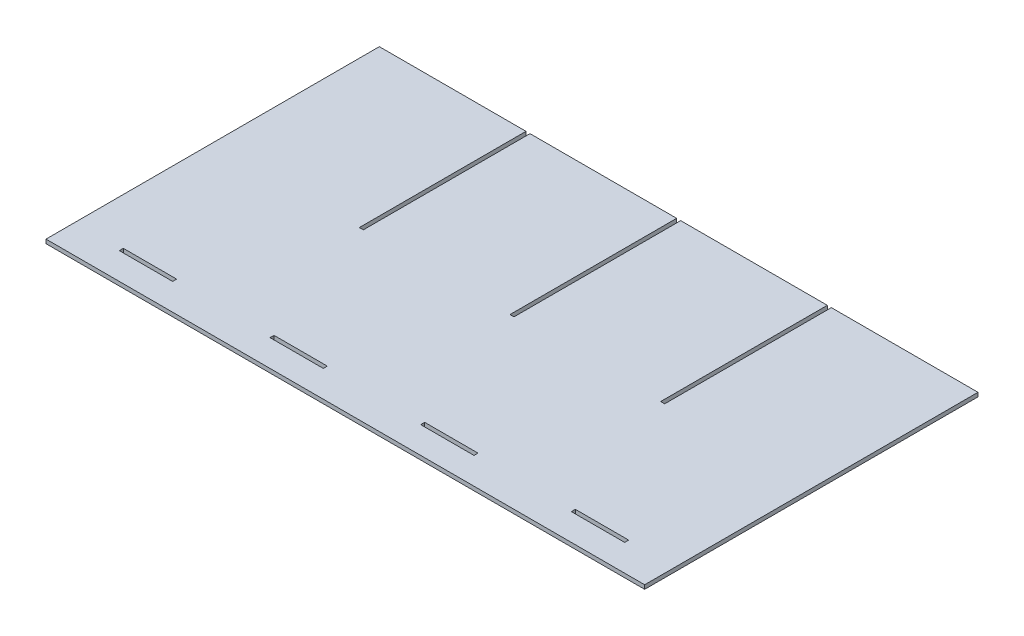
ISO-10303-21;
HEADER;
FILE_DESCRIPTION(('STEP AP214'),'2;1');
FILE_NAME('part.step','',(''),(''),'','','');
FILE_SCHEMA(('AUTOMOTIVE_DESIGN { 1 0 10303 214 1 1 1 1 }'));
ENDSEC;
DATA;
#1=APPLICATION_CONTEXT('core data for automotive mechanical design processes');
#2=APPLICATION_PROTOCOL_DEFINITION('international standard','automotive_design',2000,#1);
#3=PRODUCT_CONTEXT('',#1,'mechanical');
#4=PRODUCT('Part','Part','',(#3));
#5=PRODUCT_RELATED_PRODUCT_CATEGORY('part','',(#4));
#6=PRODUCT_DEFINITION_FORMATION('','',#4);
#7=PRODUCT_DEFINITION_CONTEXT('part definition',#1,'design');
#8=PRODUCT_DEFINITION('design','',#6,#7);
#9=PRODUCT_DEFINITION_SHAPE('','',#8);
#10=(LENGTH_UNIT() NAMED_UNIT(*) SI_UNIT(.MILLI.,.METRE.));
#11=(NAMED_UNIT(*) PLANE_ANGLE_UNIT() SI_UNIT($,.RADIAN.));
#12=(NAMED_UNIT(*) SI_UNIT($,.STERADIAN.) SOLID_ANGLE_UNIT());
#13=UNCERTAINTY_MEASURE_WITH_UNIT(LENGTH_MEASURE(1.E-05),#10,'distance_accuracy_value','');
#14=(GEOMETRIC_REPRESENTATION_CONTEXT(3) GLOBAL_UNCERTAINTY_ASSIGNED_CONTEXT((#13)) GLOBAL_UNIT_ASSIGNED_CONTEXT((#10,
#11,#12)) REPRESENTATION_CONTEXT('',''));
#15=CARTESIAN_POINT('',(0.,0.,0.));
#16=DIRECTION('',(0.,0.,1.));
#17=DIRECTION('',(1.,0.,0.));
#18=AXIS2_PLACEMENT_3D('',#15,#16,#17);
#19=CARTESIAN_POINT('',(-52.3685079528151,3.,-89.945054945055));
#20=DIRECTION('',(-1.,0.,0.));
#21=DIRECTION('',(0.,0.,1.));
#22=AXIS2_PLACEMENT_3D('',#19,#20,#21);
#23=PLANE('',#22);
#24=DIRECTION('',(0.,0.,-1.));
#25=VECTOR('',#24,1.);
#26=CARTESIAN_POINT('',(-52.3685079528151,0.,-89.945054945055));
#27=LINE('',#26,#25);
#28=CARTESIAN_POINT('',(-52.3685079528151,0.,35.054945054945));
#29=VERTEX_POINT('',#28);
#30=CARTESIAN_POINT('',(-52.3685079528151,0.,-89.945054945055));
#31=VERTEX_POINT('',#30);
#32=EDGE_CURVE('E295',#29,#31,#27,.T.);
#33=ORIENTED_EDGE('',*,*,#32,.T.);
#34=DIRECTION('',(0.,-1.,0.));
#35=VECTOR('',#34,1.);
#36=CARTESIAN_POINT('',(-52.3685079528151,3.,-89.945054945055));
#37=LINE('',#36,#35);
#38=CARTESIAN_POINT('',(-52.3685079528151,3.,-89.945054945055));
#39=VERTEX_POINT('',#38);
#40=EDGE_CURVE('E11',#39,#31,#37,.T.);
#41=ORIENTED_EDGE('',*,*,#40,.F.);
#42=DIRECTION('',(0.,0.,-1.));
#43=VECTOR('',#42,1.);
#44=CARTESIAN_POINT('',(-52.3685079528151,3.,-89.945054945055));
#45=LINE('',#44,#43);
#46=CARTESIAN_POINT('',(-52.3685079528151,3.,35.054945054945));
#47=VERTEX_POINT('',#46);
#48=EDGE_CURVE('E430',#47,#39,#45,.T.);
#49=ORIENTED_EDGE('',*,*,#48,.F.);
#50=DIRECTION('',(0.,-1.,0.));
#51=VECTOR('',#50,1.);
#52=CARTESIAN_POINT('',(-52.3685079528151,3.,35.054945054945));
#53=LINE('',#52,#51);
#54=EDGE_CURVE('E480',#47,#29,#53,.T.);
#55=ORIENTED_EDGE('',*,*,#54,.T.);
#56=EDGE_LOOP('',(#33,#41,#49,#55));
#57=FACE_BOUND('',#56,.T.);
#58=ADVANCED_FACE('F39',(#57),#23,.F.);
#59=CARTESIAN_POINT('',(-162.368507952815,3.,-89.945054945055));
#60=DIRECTION('',(0.,0.,1.));
#61=DIRECTION('',(1.,0.,0.));
#62=AXIS2_PLACEMENT_3D('',#59,#60,#61);
#63=PLANE('',#62);
#64=DIRECTION('',(-1.,0.,0.));
#65=VECTOR('',#64,1.);
#66=CARTESIAN_POINT('',(-162.368507952815,0.,-89.945054945055));
#67=LINE('',#66,#65);
#68=CARTESIAN_POINT('',(-162.368507952815,0.,-89.945054945055));
#69=VERTEX_POINT('',#68);
#70=EDGE_CURVE('E484',#31,#69,#67,.T.);
#71=ORIENTED_EDGE('',*,*,#70,.T.);
#72=DIRECTION('',(0.,-1.,0.));
#73=VECTOR('',#72,1.);
#74=CARTESIAN_POINT('',(-162.368507952815,3.,-89.945054945055));
#75=LINE('',#74,#73);
#76=CARTESIAN_POINT('',(-162.368507952815,3.,-89.945054945055));
#77=VERTEX_POINT('',#76);
#78=EDGE_CURVE('E47',#77,#69,#75,.T.);
#79=ORIENTED_EDGE('',*,*,#78,.F.);
#80=DIRECTION('',(-1.,0.,0.));
#81=VECTOR('',#80,1.);
#82=CARTESIAN_POINT('',(-162.368507952815,3.,-89.945054945055));
#83=LINE('',#82,#81);
#84=EDGE_CURVE('E434',#39,#77,#83,.T.);
#85=ORIENTED_EDGE('',*,*,#84,.F.);
#86=ORIENTED_EDGE('',*,*,#40,.T.);
#87=EDGE_LOOP('',(#71,#79,#85,#86));
#88=FACE_BOUND('',#87,.T.);
#89=ADVANCED_FACE('F610',(#88),#63,.F.);
#90=CARTESIAN_POINT('',(-162.368507952815,3.,160.054945054945));
#91=DIRECTION('',(1.,0.,0.));
#92=DIRECTION('',(0.,0.,-1.));
#93=AXIS2_PLACEMENT_3D('',#90,#91,#92);
#94=PLANE('',#93);
#95=DIRECTION('',(0.,0.,1.));
#96=VECTOR('',#95,1.);
#97=CARTESIAN_POINT('',(-162.368507952815,0.,160.054945054945));
#98=LINE('',#97,#96);
#99=CARTESIAN_POINT('',(-162.368507952815,0.,160.054945054945));
#100=VERTEX_POINT('',#99);
#101=EDGE_CURVE('E487',#69,#100,#98,.T.);
#102=ORIENTED_EDGE('',*,*,#101,.T.);
#103=DIRECTION('',(0.,-1.,0.));
#104=VECTOR('',#103,1.);
#105=CARTESIAN_POINT('',(-162.368507952815,3.,160.054945054945));
#106=LINE('',#105,#104);
#107=CARTESIAN_POINT('',(-162.368507952815,3.,160.054945054945));
#108=VERTEX_POINT('',#107);
#109=EDGE_CURVE('E579',#108,#100,#106,.T.);
#110=ORIENTED_EDGE('',*,*,#109,.F.);
#111=DIRECTION('',(0.,0.,1.));
#112=VECTOR('',#111,1.);
#113=CARTESIAN_POINT('',(-162.368507952815,3.,160.054945054945));
#114=LINE('',#113,#112);
#115=EDGE_CURVE('E438',#77,#108,#114,.T.);
#116=ORIENTED_EDGE('',*,*,#115,.F.);
#117=ORIENTED_EDGE('',*,*,#78,.T.);
#118=EDGE_LOOP('',(#102,#110,#116,#117));
#119=FACE_BOUND('',#118,.T.);
#120=ADVANCED_FACE('F588',(#119),#94,.F.);
#121=CARTESIAN_POINT('',(286.631492047185,3.,160.054945054945));
#122=DIRECTION('',(0.,0.,-1.));
#123=DIRECTION('',(-1.,0.,0.));
#124=AXIS2_PLACEMENT_3D('',#121,#122,#123);
#125=PLANE('',#124);
#126=DIRECTION('',(1.,0.,0.));
#127=VECTOR('',#126,1.);
#128=CARTESIAN_POINT('',(286.631492047185,0.,160.054945054945));
#129=LINE('',#128,#127);
#130=CARTESIAN_POINT('',(286.631492047185,0.,160.054945054945));
#131=VERTEX_POINT('',#130);
#132=EDGE_CURVE('E490',#100,#131,#129,.T.);
#133=ORIENTED_EDGE('',*,*,#132,.T.);
#134=DIRECTION('',(0.,-1.,0.));
#135=VECTOR('',#134,1.);
#136=CARTESIAN_POINT('',(286.631492047185,3.,160.054945054945));
#137=LINE('',#136,#135);
#138=CARTESIAN_POINT('',(286.631492047185,3.,160.054945054945));
#139=VERTEX_POINT('',#138);
#140=EDGE_CURVE('E575',#139,#131,#137,.T.);
#141=ORIENTED_EDGE('',*,*,#140,.F.);
#142=DIRECTION('',(1.,0.,0.));
#143=VECTOR('',#142,1.);
#144=CARTESIAN_POINT('',(286.631492047185,3.,160.054945054945));
#145=LINE('',#144,#143);
#146=EDGE_CURVE('E441',#108,#139,#145,.T.);
#147=ORIENTED_EDGE('',*,*,#146,.F.);
#148=ORIENTED_EDGE('',*,*,#109,.T.);
#149=EDGE_LOOP('',(#133,#141,#147,#148));
#150=FACE_BOUND('',#149,.T.);
#151=ADVANCED_FACE('F598',(#150),#125,.F.);
#152=CARTESIAN_POINT('',(286.631492047185,3.,-89.945054945055));
#153=DIRECTION('',(-1.,0.,0.));
#154=DIRECTION('',(0.,0.,1.));
#155=AXIS2_PLACEMENT_3D('',#152,#153,#154);
#156=PLANE('',#155);
#157=DIRECTION('',(0.,0.,-1.));
#158=VECTOR('',#157,1.);
#159=CARTESIAN_POINT('',(286.631492047185,0.,-89.945054945055));
#160=LINE('',#159,#158);
#161=CARTESIAN_POINT('',(286.631492047185,0.,-89.945054945055));
#162=VERTEX_POINT('',#161);
#163=EDGE_CURVE('E493',#131,#162,#160,.T.);
#164=ORIENTED_EDGE('',*,*,#163,.T.);
#165=DIRECTION('',(0.,-1.,0.));
#166=VECTOR('',#165,1.);
#167=CARTESIAN_POINT('',(286.631492047185,3.,-89.945054945055));
#168=LINE('',#167,#166);
#169=CARTESIAN_POINT('',(286.631492047185,3.,-89.945054945055));
#170=VERTEX_POINT('',#169);
#171=EDGE_CURVE('E571',#170,#162,#168,.T.);
#172=ORIENTED_EDGE('',*,*,#171,.F.);
#173=DIRECTION('',(0.,0.,-1.));
#174=VECTOR('',#173,1.);
#175=CARTESIAN_POINT('',(286.631492047185,3.,-89.945054945055));
#176=LINE('',#175,#174);
#177=EDGE_CURVE('E444',#139,#170,#176,.T.);
#178=ORIENTED_EDGE('',*,*,#177,.F.);
#179=ORIENTED_EDGE('',*,*,#140,.T.);
#180=EDGE_LOOP('',(#164,#172,#178,#179));
#181=FACE_BOUND('',#180,.T.);
#182=ADVANCED_FACE('F602',(#181),#156,.F.);
#183=CARTESIAN_POINT('',(176.631492047185,3.,-89.945054945055));
#184=DIRECTION('',(0.,0.,1.));
#185=DIRECTION('',(1.,0.,0.));
#186=AXIS2_PLACEMENT_3D('',#183,#184,#185);
#187=PLANE('',#186);
#188=DIRECTION('',(-1.,0.,0.));
#189=VECTOR('',#188,1.);
#190=CARTESIAN_POINT('',(176.631492047185,0.,-89.945054945055));
#191=LINE('',#190,#189);
#192=CARTESIAN_POINT('',(176.631492047185,0.,-89.945054945055));
#193=VERTEX_POINT('',#192);
#194=EDGE_CURVE('E496',#162,#193,#191,.T.);
#195=ORIENTED_EDGE('',*,*,#194,.T.);
#196=DIRECTION('',(0.,-1.,0.));
#197=VECTOR('',#196,1.);
#198=CARTESIAN_POINT('',(176.631492047185,3.,-89.945054945055));
#199=LINE('',#198,#197);
#200=CARTESIAN_POINT('',(176.631492047185,3.,-89.945054945055));
#201=VERTEX_POINT('',#200);
#202=EDGE_CURVE('E567',#201,#193,#199,.T.);
#203=ORIENTED_EDGE('',*,*,#202,.F.);
#204=DIRECTION('',(-1.,0.,0.));
#205=VECTOR('',#204,1.);
#206=CARTESIAN_POINT('',(176.631492047185,3.,-89.945054945055));
#207=LINE('',#206,#205);
#208=EDGE_CURVE('E447',#170,#201,#207,.T.);
#209=ORIENTED_EDGE('',*,*,#208,.F.);
#210=ORIENTED_EDGE('',*,*,#171,.T.);
#211=EDGE_LOOP('',(#195,#203,#209,#210));
#212=FACE_BOUND('',#211,.T.);
#213=ADVANCED_FACE('F663',(#212),#187,.F.);
#214=CARTESIAN_POINT('',(176.631492047185,3.,35.054945054945));
#215=DIRECTION('',(1.,0.,0.));
#216=DIRECTION('',(0.,0.,-1.));
#217=AXIS2_PLACEMENT_3D('',#214,#215,#216);
#218=PLANE('',#217);
#219=DIRECTION('',(0.,0.,1.));
#220=VECTOR('',#219,1.);
#221=CARTESIAN_POINT('',(176.631492047185,0.,35.054945054945));
#222=LINE('',#221,#220);
#223=CARTESIAN_POINT('',(176.631492047185,0.,35.054945054945));
#224=VERTEX_POINT('',#223);
#225=EDGE_CURVE('E499',#193,#224,#222,.T.);
#226=ORIENTED_EDGE('',*,*,#225,.T.);
#227=DIRECTION('',(0.,-1.,0.));
#228=VECTOR('',#227,1.);
#229=CARTESIAN_POINT('',(176.631492047185,3.,35.054945054945));
#230=LINE('',#229,#228);
#231=CARTESIAN_POINT('',(176.631492047185,3.,35.054945054945));
#232=VERTEX_POINT('',#231);
#233=EDGE_CURVE('E563',#232,#224,#230,.T.);
#234=ORIENTED_EDGE('',*,*,#233,.F.);
#235=DIRECTION('',(0.,0.,1.));
#236=VECTOR('',#235,1.);
#237=CARTESIAN_POINT('',(176.631492047185,3.,35.054945054945));
#238=LINE('',#237,#236);
#239=EDGE_CURVE('E450',#201,#232,#238,.T.);
#240=ORIENTED_EDGE('',*,*,#239,.F.);
#241=ORIENTED_EDGE('',*,*,#202,.T.);
#242=EDGE_LOOP('',(#226,#234,#240,#241));
#243=FACE_BOUND('',#242,.T.);
#244=ADVANCED_FACE('F660',(#243),#218,.F.);
#245=CARTESIAN_POINT('',(173.631492047185,3.,35.054945054945));
#246=DIRECTION('',(0.,0.,1.));
#247=DIRECTION('',(1.,0.,0.));
#248=AXIS2_PLACEMENT_3D('',#245,#246,#247);
#249=PLANE('',#248);
#250=DIRECTION('',(-1.,0.,0.));
#251=VECTOR('',#250,1.);
#252=CARTESIAN_POINT('',(173.631492047185,0.,35.054945054945));
#253=LINE('',#252,#251);
#254=CARTESIAN_POINT('',(173.631492047185,0.,35.054945054945));
#255=VERTEX_POINT('',#254);
#256=EDGE_CURVE('E502',#224,#255,#253,.T.);
#257=ORIENTED_EDGE('',*,*,#256,.T.);
#258=DIRECTION('',(0.,-1.,0.));
#259=VECTOR('',#258,1.);
#260=CARTESIAN_POINT('',(173.631492047185,3.,35.054945054945));
#261=LINE('',#260,#259);
#262=CARTESIAN_POINT('',(173.631492047185,3.,35.054945054945));
#263=VERTEX_POINT('',#262);
#264=EDGE_CURVE('E559',#263,#255,#261,.T.);
#265=ORIENTED_EDGE('',*,*,#264,.F.);
#266=DIRECTION('',(-1.,0.,0.));
#267=VECTOR('',#266,1.);
#268=CARTESIAN_POINT('',(173.631492047185,3.,35.054945054945));
#269=LINE('',#268,#267);
#270=EDGE_CURVE('E453',#232,#263,#269,.T.);
#271=ORIENTED_EDGE('',*,*,#270,.F.);
#272=ORIENTED_EDGE('',*,*,#233,.T.);
#273=EDGE_LOOP('',(#257,#265,#271,#272));
#274=FACE_BOUND('',#273,.T.);
#275=ADVANCED_FACE('F656',(#274),#249,.F.);
#276=CARTESIAN_POINT('',(173.631492047185,3.,-89.945054945055));
#277=DIRECTION('',(-1.,0.,0.));
#278=DIRECTION('',(0.,0.,1.));
#279=AXIS2_PLACEMENT_3D('',#276,#277,#278);
#280=PLANE('',#279);
#281=DIRECTION('',(0.,0.,-1.));
#282=VECTOR('',#281,1.);
#283=CARTESIAN_POINT('',(173.631492047185,0.,-89.945054945055));
#284=LINE('',#283,#282);
#285=CARTESIAN_POINT('',(173.631492047185,0.,-89.945054945055));
#286=VERTEX_POINT('',#285);
#287=EDGE_CURVE('E505',#255,#286,#284,.T.);
#288=ORIENTED_EDGE('',*,*,#287,.T.);
#289=DIRECTION('',(0.,-1.,0.));
#290=VECTOR('',#289,1.);
#291=CARTESIAN_POINT('',(173.631492047185,3.,-89.945054945055));
#292=LINE('',#291,#290);
#293=CARTESIAN_POINT('',(173.631492047185,3.,-89.945054945055));
#294=VERTEX_POINT('',#293);
#295=EDGE_CURVE('E555',#294,#286,#292,.T.);
#296=ORIENTED_EDGE('',*,*,#295,.F.);
#297=DIRECTION('',(0.,0.,-1.));
#298=VECTOR('',#297,1.);
#299=CARTESIAN_POINT('',(173.631492047185,3.,-89.945054945055));
#300=LINE('',#299,#298);
#301=EDGE_CURVE('E456',#263,#294,#300,.T.);
#302=ORIENTED_EDGE('',*,*,#301,.F.);
#303=ORIENTED_EDGE('',*,*,#264,.T.);
#304=EDGE_LOOP('',(#288,#296,#302,#303));
#305=FACE_BOUND('',#304,.T.);
#306=ADVANCED_FACE('F652',(#305),#280,.F.);
#307=CARTESIAN_POINT('',(63.631492047185,3.,-89.945054945055));
#308=DIRECTION('',(0.,0.,1.));
#309=DIRECTION('',(1.,0.,0.));
#310=AXIS2_PLACEMENT_3D('',#307,#308,#309);
#311=PLANE('',#310);
#312=DIRECTION('',(-1.,0.,0.));
#313=VECTOR('',#312,1.);
#314=CARTESIAN_POINT('',(63.631492047185,0.,-89.945054945055));
#315=LINE('',#314,#313);
#316=CARTESIAN_POINT('',(63.631492047185,0.,-89.945054945055));
#317=VERTEX_POINT('',#316);
#318=EDGE_CURVE('E508',#286,#317,#315,.T.);
#319=ORIENTED_EDGE('',*,*,#318,.T.);
#320=DIRECTION('',(0.,-1.,0.));
#321=VECTOR('',#320,1.);
#322=CARTESIAN_POINT('',(63.631492047185,3.,-89.945054945055));
#323=LINE('',#322,#321);
#324=CARTESIAN_POINT('',(63.631492047185,3.,-89.945054945055));
#325=VERTEX_POINT('',#324);
#326=EDGE_CURVE('E551',#325,#317,#323,.T.);
#327=ORIENTED_EDGE('',*,*,#326,.F.);
#328=DIRECTION('',(-1.,0.,0.));
#329=VECTOR('',#328,1.);
#330=CARTESIAN_POINT('',(63.631492047185,3.,-89.945054945055));
#331=LINE('',#330,#329);
#332=EDGE_CURVE('E459',#294,#325,#331,.T.);
#333=ORIENTED_EDGE('',*,*,#332,.F.);
#334=ORIENTED_EDGE('',*,*,#295,.T.);
#335=EDGE_LOOP('',(#319,#327,#333,#334));
#336=FACE_BOUND('',#335,.T.);
#337=ADVANCED_FACE('F647',(#336),#311,.F.);
#338=CARTESIAN_POINT('',(63.631492047185,3.,35.054945054945));
#339=DIRECTION('',(1.,0.,0.));
#340=DIRECTION('',(0.,0.,-1.));
#341=AXIS2_PLACEMENT_3D('',#338,#339,#340);
#342=PLANE('',#341);
#343=DIRECTION('',(0.,0.,1.));
#344=VECTOR('',#343,1.);
#345=CARTESIAN_POINT('',(63.631492047185,0.,35.054945054945));
#346=LINE('',#345,#344);
#347=CARTESIAN_POINT('',(63.631492047185,0.,35.054945054945));
#348=VERTEX_POINT('',#347);
#349=EDGE_CURVE('E511',#317,#348,#346,.T.);
#350=ORIENTED_EDGE('',*,*,#349,.T.);
#351=DIRECTION('',(0.,-1.,0.));
#352=VECTOR('',#351,1.);
#353=CARTESIAN_POINT('',(63.631492047185,3.,35.054945054945));
#354=LINE('',#353,#352);
#355=CARTESIAN_POINT('',(63.631492047185,3.,35.054945054945));
#356=VERTEX_POINT('',#355);
#357=EDGE_CURVE('E547',#356,#348,#354,.T.);
#358=ORIENTED_EDGE('',*,*,#357,.F.);
#359=DIRECTION('',(0.,0.,1.));
#360=VECTOR('',#359,1.);
#361=CARTESIAN_POINT('',(63.631492047185,3.,35.054945054945));
#362=LINE('',#361,#360);
#363=EDGE_CURVE('E462',#325,#356,#362,.T.);
#364=ORIENTED_EDGE('',*,*,#363,.F.);
#365=ORIENTED_EDGE('',*,*,#326,.T.);
#366=EDGE_LOOP('',(#350,#358,#364,#365));
#367=FACE_BOUND('',#366,.T.);
#368=ADVANCED_FACE('F641',(#367),#342,.F.);
#369=CARTESIAN_POINT('',(60.631492047185,3.,35.054945054945));
#370=DIRECTION('',(0.,0.,1.));
#371=DIRECTION('',(1.,0.,0.));
#372=AXIS2_PLACEMENT_3D('',#369,#370,#371);
#373=PLANE('',#372);
#374=DIRECTION('',(-1.,0.,0.));
#375=VECTOR('',#374,1.);
#376=CARTESIAN_POINT('',(60.631492047185,0.,35.054945054945));
#377=LINE('',#376,#375);
#378=CARTESIAN_POINT('',(60.631492047185,0.,35.054945054945));
#379=VERTEX_POINT('',#378);
#380=EDGE_CURVE('E514',#348,#379,#377,.T.);
#381=ORIENTED_EDGE('',*,*,#380,.T.);
#382=DIRECTION('',(0.,-1.,0.));
#383=VECTOR('',#382,1.);
#384=CARTESIAN_POINT('',(60.631492047185,3.,35.054945054945));
#385=LINE('',#384,#383);
#386=CARTESIAN_POINT('',(60.631492047185,3.,35.054945054945));
#387=VERTEX_POINT('',#386);
#388=EDGE_CURVE('E543',#387,#379,#385,.T.);
#389=ORIENTED_EDGE('',*,*,#388,.F.);
#390=DIRECTION('',(-1.,0.,0.));
#391=VECTOR('',#390,1.);
#392=CARTESIAN_POINT('',(60.631492047185,3.,35.054945054945));
#393=LINE('',#392,#391);
#394=EDGE_CURVE('E465',#356,#387,#393,.T.);
#395=ORIENTED_EDGE('',*,*,#394,.F.);
#396=ORIENTED_EDGE('',*,*,#357,.T.);
#397=EDGE_LOOP('',(#381,#389,#395,#396));
#398=FACE_BOUND('',#397,.T.);
#399=ADVANCED_FACE('F637',(#398),#373,.F.);
#400=CARTESIAN_POINT('',(60.6314920471849,3.,-89.945054945055));
#401=DIRECTION('',(-1.,0.,0.));
#402=DIRECTION('',(0.,0.,1.));
#403=AXIS2_PLACEMENT_3D('',#400,#401,#402);
#404=PLANE('',#403);
#405=DIRECTION('',(0.,0.,-1.));
#406=VECTOR('',#405,1.);
#407=CARTESIAN_POINT('',(60.6314920471849,0.,-89.945054945055));
#408=LINE('',#407,#406);
#409=CARTESIAN_POINT('',(60.6314920471849,0.,-89.945054945055));
#410=VERTEX_POINT('',#409);
#411=EDGE_CURVE('E517',#379,#410,#408,.T.);
#412=ORIENTED_EDGE('',*,*,#411,.T.);
#413=DIRECTION('',(0.,-1.,0.));
#414=VECTOR('',#413,1.);
#415=CARTESIAN_POINT('',(60.6314920471849,3.,-89.945054945055));
#416=LINE('',#415,#414);
#417=CARTESIAN_POINT('',(60.6314920471849,3.,-89.945054945055));
#418=VERTEX_POINT('',#417);
#419=EDGE_CURVE('E539',#418,#410,#416,.T.);
#420=ORIENTED_EDGE('',*,*,#419,.F.);
#421=DIRECTION('',(0.,0.,-1.));
#422=VECTOR('',#421,1.);
#423=CARTESIAN_POINT('',(60.6314920471849,3.,-89.945054945055));
#424=LINE('',#423,#422);
#425=EDGE_CURVE('E468',#387,#418,#424,.T.);
#426=ORIENTED_EDGE('',*,*,#425,.F.);
#427=ORIENTED_EDGE('',*,*,#388,.T.);
#428=EDGE_LOOP('',(#412,#420,#426,#427));
#429=FACE_BOUND('',#428,.T.);
#430=ADVANCED_FACE('F632',(#429),#404,.F.);
#431=CARTESIAN_POINT('',(-49.3685079528151,3.,-89.945054945055));
#432=DIRECTION('',(0.,0.,1.));
#433=DIRECTION('',(1.,0.,0.));
#434=AXIS2_PLACEMENT_3D('',#431,#432,#433);
#435=PLANE('',#434);
#436=DIRECTION('',(-1.,0.,0.));
#437=VECTOR('',#436,1.);
#438=CARTESIAN_POINT('',(-49.3685079528151,0.,-89.945054945055));
#439=LINE('',#438,#437);
#440=CARTESIAN_POINT('',(-49.3685079528151,0.,-89.945054945055));
#441=VERTEX_POINT('',#440);
#442=EDGE_CURVE('E520',#410,#441,#439,.T.);
#443=ORIENTED_EDGE('',*,*,#442,.T.);
#444=DIRECTION('',(0.,-1.,0.));
#445=VECTOR('',#444,1.);
#446=CARTESIAN_POINT('',(-49.3685079528151,3.,-89.945054945055));
#447=LINE('',#446,#445);
#448=CARTESIAN_POINT('',(-49.3685079528151,3.,-89.945054945055));
#449=VERTEX_POINT('',#448);
#450=EDGE_CURVE('E535',#449,#441,#447,.T.);
#451=ORIENTED_EDGE('',*,*,#450,.F.);
#452=DIRECTION('',(-1.,0.,0.));
#453=VECTOR('',#452,1.);
#454=CARTESIAN_POINT('',(-49.3685079528151,3.,-89.945054945055));
#455=LINE('',#454,#453);
#456=EDGE_CURVE('E471',#418,#449,#455,.T.);
#457=ORIENTED_EDGE('',*,*,#456,.F.);
#458=ORIENTED_EDGE('',*,*,#419,.T.);
#459=EDGE_LOOP('',(#443,#451,#457,#458));
#460=FACE_BOUND('',#459,.T.);
#461=ADVANCED_FACE('F626',(#460),#435,.F.);
#462=CARTESIAN_POINT('',(-49.3685079528151,3.,35.054945054945));
#463=DIRECTION('',(1.,0.,0.));
#464=DIRECTION('',(0.,0.,-1.));
#465=AXIS2_PLACEMENT_3D('',#462,#463,#464);
#466=PLANE('',#465);
#467=DIRECTION('',(0.,0.,1.));
#468=VECTOR('',#467,1.);
#469=CARTESIAN_POINT('',(-49.3685079528151,0.,35.054945054945));
#470=LINE('',#469,#468);
#471=CARTESIAN_POINT('',(-49.3685079528151,0.,35.054945054945));
#472=VERTEX_POINT('',#471);
#473=EDGE_CURVE('E523',#441,#472,#470,.T.);
#474=ORIENTED_EDGE('',*,*,#473,.T.);
#475=DIRECTION('',(0.,-1.,0.));
#476=VECTOR('',#475,1.);
#477=CARTESIAN_POINT('',(-49.3685079528151,3.,35.054945054945));
#478=LINE('',#477,#476);
#479=CARTESIAN_POINT('',(-49.3685079528151,3.,35.054945054945));
#480=VERTEX_POINT('',#479);
#481=EDGE_CURVE('E531',#480,#472,#478,.T.);
#482=ORIENTED_EDGE('',*,*,#481,.F.);
#483=DIRECTION('',(0.,0.,1.));
#484=VECTOR('',#483,1.);
#485=CARTESIAN_POINT('',(-49.3685079528151,3.,35.054945054945));
#486=LINE('',#485,#484);
#487=EDGE_CURVE('E474',#449,#480,#486,.T.);
#488=ORIENTED_EDGE('',*,*,#487,.F.);
#489=ORIENTED_EDGE('',*,*,#450,.T.);
#490=EDGE_LOOP('',(#474,#482,#488,#489));
#491=FACE_BOUND('',#490,.T.);
#492=ADVANCED_FACE('F622',(#491),#466,.F.);
#493=CARTESIAN_POINT('',(-49.3685079528151,3.,35.054945054945));
#494=DIRECTION('',(0.,0.,1.));
#495=DIRECTION('',(1.,0.,0.));
#496=AXIS2_PLACEMENT_3D('',#493,#494,#495);
#497=PLANE('',#496);
#498=DIRECTION('',(-1.,0.,0.));
#499=VECTOR('',#498,1.);
#500=CARTESIAN_POINT('',(-49.3685079528151,0.,35.054945054945));
#501=LINE('',#500,#499);
#502=EDGE_CURVE('E435',#472,#29,#501,.T.);
#503=ORIENTED_EDGE('',*,*,#502,.T.);
#504=ORIENTED_EDGE('',*,*,#54,.F.);
#505=DIRECTION('',(-1.,0.,0.));
#506=VECTOR('',#505,1.);
#507=CARTESIAN_POINT('',(-49.3685079528151,3.,35.054945054945));
#508=LINE('',#507,#506);
#509=EDGE_CURVE('E477',#480,#47,#508,.T.);
#510=ORIENTED_EDGE('',*,*,#509,.F.);
#511=ORIENTED_EDGE('',*,*,#481,.T.);
#512=EDGE_LOOP('',(#503,#504,#510,#511));
#513=FACE_BOUND('',#512,.T.);
#514=ADVANCED_FACE('F617',(#513),#497,.F.);
#515=CARTESIAN_POINT('',(0.,3.,0.));
#516=DIRECTION('',(0.,-1.,0.));
#517=DIRECTION('',(0.,0.,-1.));
#518=AXIS2_PLACEMENT_3D('',#515,#516,#517);
#519=PLANE('',#518);
#520=DIRECTION('',(1.,0.,0.));
#521=VECTOR('',#520,1.);
#522=CARTESIAN_POINT('',(-127.368507952815,3.,140.054945054945));
#523=LINE('',#522,#521);
#524=CARTESIAN_POINT('',(-127.368507952815,3.,140.054945054945));
#525=VERTEX_POINT('',#524);
#526=CARTESIAN_POINT('',(-87.3685079528151,3.,140.054945054945));
#527=VERTEX_POINT('',#526);
#528=EDGE_CURVE('E285',#525,#527,#523,.T.);
#529=ORIENTED_EDGE('',*,*,#528,.F.);
#530=DIRECTION('',(0.,0.,1.));
#531=VECTOR('',#530,1.);
#532=CARTESIAN_POINT('',(-127.368507952815,3.,137.054945054945));
#533=LINE('',#532,#531);
#534=CARTESIAN_POINT('',(-127.368507952815,3.,137.054945054945));
#535=VERTEX_POINT('',#534);
#536=EDGE_CURVE('E54',#535,#525,#533,.T.);
#537=ORIENTED_EDGE('',*,*,#536,.F.);
#538=DIRECTION('',(-1.,0.,0.));
#539=VECTOR('',#538,1.);
#540=CARTESIAN_POINT('',(-127.368507952815,3.,137.054945054945));
#541=LINE('',#540,#539);
#542=CARTESIAN_POINT('',(-87.3685079528151,3.,137.054945054945));
#543=VERTEX_POINT('',#542);
#544=EDGE_CURVE('E272',#543,#535,#541,.T.);
#545=ORIENTED_EDGE('',*,*,#544,.F.);
#546=DIRECTION('',(0.,0.,-1.));
#547=VECTOR('',#546,1.);
#548=CARTESIAN_POINT('',(-87.3685079528151,3.,137.054945054945));
#549=LINE('',#548,#547);
#550=EDGE_CURVE('E276',#527,#543,#549,.T.);
#551=ORIENTED_EDGE('',*,*,#550,.F.);
#552=EDGE_LOOP('',(#529,#537,#545,#551));
#553=FACE_BOUND('',#552,.T.);
#554=DIRECTION('',(1.,0.,0.));
#555=VECTOR('',#554,1.);
#556=CARTESIAN_POINT('',(-14.3685079528151,3.,140.054945054945));
#557=LINE('',#556,#555);
#558=CARTESIAN_POINT('',(-14.3685079528151,3.,140.054945054945));
#559=VERTEX_POINT('',#558);
#560=CARTESIAN_POINT('',(25.6314920471849,3.,140.054945054945));
#561=VERTEX_POINT('',#560);
#562=EDGE_CURVE('E321',#559,#561,#557,.T.);
#563=ORIENTED_EDGE('',*,*,#562,.F.);
#564=DIRECTION('',(0.,0.,1.));
#565=VECTOR('',#564,1.);
#566=CARTESIAN_POINT('',(-14.3685079528151,3.,137.054945054945));
#567=LINE('',#566,#565);
#568=CARTESIAN_POINT('',(-14.3685079528151,3.,137.054945054945));
#569=VERTEX_POINT('',#568);
#570=EDGE_CURVE('E62',#569,#559,#567,.T.);
#571=ORIENTED_EDGE('',*,*,#570,.F.);
#572=DIRECTION('',(-1.,0.,0.));
#573=VECTOR('',#572,1.);
#574=CARTESIAN_POINT('',(-14.3685079528151,3.,137.054945054945));
#575=LINE('',#574,#573);
#576=CARTESIAN_POINT('',(25.6314920471849,3.,137.054945054945));
#577=VERTEX_POINT('',#576);
#578=EDGE_CURVE('E306',#577,#569,#575,.T.);
#579=ORIENTED_EDGE('',*,*,#578,.F.);
#580=DIRECTION('',(0.,0.,-1.));
#581=VECTOR('',#580,1.);
#582=CARTESIAN_POINT('',(25.6314920471849,3.,137.054945054945));
#583=LINE('',#582,#581);
#584=EDGE_CURVE('E326',#561,#577,#583,.T.);
#585=ORIENTED_EDGE('',*,*,#584,.F.);
#586=EDGE_LOOP('',(#563,#571,#579,#585));
#587=FACE_BOUND('',#586,.T.);
#588=DIRECTION('',(1.,0.,0.));
#589=VECTOR('',#588,1.);
#590=CARTESIAN_POINT('',(98.631492047185,3.,140.054945054945));
#591=LINE('',#590,#589);
#592=CARTESIAN_POINT('',(98.631492047185,3.,140.054945054945));
#593=VERTEX_POINT('',#592);
#594=CARTESIAN_POINT('',(138.631492047185,3.,140.054945054945));
#595=VERTEX_POINT('',#594);
#596=EDGE_CURVE('E364',#593,#595,#591,.T.);
#597=ORIENTED_EDGE('',*,*,#596,.F.);
#598=DIRECTION('',(0.,0.,1.));
#599=VECTOR('',#598,1.);
#600=CARTESIAN_POINT('',(98.631492047185,3.,137.054945054945));
#601=LINE('',#600,#599);
#602=CARTESIAN_POINT('',(98.631492047185,3.,137.054945054945));
#603=VERTEX_POINT('',#602);
#604=EDGE_CURVE('E361',#603,#593,#601,.T.);
#605=ORIENTED_EDGE('',*,*,#604,.F.);
#606=DIRECTION('',(-1.,0.,0.));
#607=VECTOR('',#606,1.);
#608=CARTESIAN_POINT('',(98.631492047185,3.,137.054945054945));
#609=LINE('',#608,#607);
#610=CARTESIAN_POINT('',(138.631492047185,3.,137.054945054945));
#611=VERTEX_POINT('',#610);
#612=EDGE_CURVE('E348',#611,#603,#609,.T.);
#613=ORIENTED_EDGE('',*,*,#612,.F.);
#614=DIRECTION('',(0.,0.,-1.));
#615=VECTOR('',#614,1.);
#616=CARTESIAN_POINT('',(138.631492047185,3.,137.054945054945));
#617=LINE('',#616,#615);
#618=EDGE_CURVE('E369',#595,#611,#617,.T.);
#619=ORIENTED_EDGE('',*,*,#618,.F.);
#620=EDGE_LOOP('',(#597,#605,#613,#619));
#621=FACE_BOUND('',#620,.T.);
#622=DIRECTION('',(1.,0.,0.));
#623=VECTOR('',#622,1.);
#624=CARTESIAN_POINT('',(211.631492047185,3.,140.054945054945));
#625=LINE('',#624,#623);
#626=CARTESIAN_POINT('',(211.631492047185,3.,140.054945054945));
#627=VERTEX_POINT('',#626);
#628=CARTESIAN_POINT('',(251.631492047185,3.,140.054945054945));
#629=VERTEX_POINT('',#628);
#630=EDGE_CURVE('E408',#627,#629,#625,.T.);
#631=ORIENTED_EDGE('',*,*,#630,.F.);
#632=DIRECTION('',(0.,0.,1.));
#633=VECTOR('',#632,1.);
#634=CARTESIAN_POINT('',(211.631492047185,3.,137.054945054945));
#635=LINE('',#634,#633);
#636=CARTESIAN_POINT('',(211.631492047185,3.,137.054945054945));
#637=VERTEX_POINT('',#636);
#638=EDGE_CURVE('E405',#637,#627,#635,.T.);
#639=ORIENTED_EDGE('',*,*,#638,.F.);
#640=DIRECTION('',(-1.,0.,0.));
#641=VECTOR('',#640,1.);
#642=CARTESIAN_POINT('',(211.631492047185,3.,137.054945054945));
#643=LINE('',#642,#641);
#644=CARTESIAN_POINT('',(251.631492047185,3.,137.054945054945));
#645=VERTEX_POINT('',#644);
#646=EDGE_CURVE('E392',#645,#637,#643,.T.);
#647=ORIENTED_EDGE('',*,*,#646,.F.);
#648=DIRECTION('',(0.,0.,-1.));
#649=VECTOR('',#648,1.);
#650=CARTESIAN_POINT('',(251.631492047185,3.,137.054945054945));
#651=LINE('',#650,#649);
#652=EDGE_CURVE('E412',#629,#645,#651,.T.);
#653=ORIENTED_EDGE('',*,*,#652,.F.);
#654=EDGE_LOOP('',(#631,#639,#647,#653));
#655=FACE_BOUND('',#654,.T.);
#656=ORIENTED_EDGE('',*,*,#48,.T.);
#657=ORIENTED_EDGE('',*,*,#84,.T.);
#658=ORIENTED_EDGE('',*,*,#115,.T.);
#659=ORIENTED_EDGE('',*,*,#146,.T.);
#660=ORIENTED_EDGE('',*,*,#177,.T.);
#661=ORIENTED_EDGE('',*,*,#208,.T.);
#662=ORIENTED_EDGE('',*,*,#239,.T.);
#663=ORIENTED_EDGE('',*,*,#270,.T.);
#664=ORIENTED_EDGE('',*,*,#301,.T.);
#665=ORIENTED_EDGE('',*,*,#332,.T.);
#666=ORIENTED_EDGE('',*,*,#363,.T.);
#667=ORIENTED_EDGE('',*,*,#394,.T.);
#668=ORIENTED_EDGE('',*,*,#425,.T.);
#669=ORIENTED_EDGE('',*,*,#456,.T.);
#670=ORIENTED_EDGE('',*,*,#487,.T.);
#671=ORIENTED_EDGE('',*,*,#509,.T.);
#672=EDGE_LOOP('',(#656,#657,#658,#659,#660,#661,#662,#663,#664,#665,#666,#667,#668,#669,#670,#671));
#673=FACE_BOUND('',#672,.T.);
#674=ADVANCED_FACE('F606',(#553,#587,#621,#655,#673),#519,.F.);
#675=CARTESIAN_POINT('',(0.,0.,0.));
#676=DIRECTION('',(0.,-1.,0.));
#677=DIRECTION('',(0.,0.,-1.));
#678=AXIS2_PLACEMENT_3D('',#675,#676,#677);
#679=PLANE('',#678);
#680=DIRECTION('',(0.,0.,1.));
#681=VECTOR('',#680,1.);
#682=CARTESIAN_POINT('',(-127.368507952815,0.,137.054945054945));
#683=LINE('',#682,#681);
#684=CARTESIAN_POINT('',(-127.368507952815,0.,137.054945054945));
#685=VERTEX_POINT('',#684);
#686=CARTESIAN_POINT('',(-127.368507952815,0.,140.054945054945));
#687=VERTEX_POINT('',#686);
#688=EDGE_CURVE('E250',#685,#687,#683,.T.);
#689=ORIENTED_EDGE('',*,*,#688,.T.);
#690=DIRECTION('',(1.,0.,0.));
#691=VECTOR('',#690,1.);
#692=CARTESIAN_POINT('',(-127.368507952815,0.,140.054945054945));
#693=LINE('',#692,#691);
#694=CARTESIAN_POINT('',(-87.3685079528151,0.,140.054945054945));
#695=VERTEX_POINT('',#694);
#696=EDGE_CURVE('E261',#687,#695,#693,.T.);
#697=ORIENTED_EDGE('',*,*,#696,.T.);
#698=DIRECTION('',(0.,0.,-1.));
#699=VECTOR('',#698,1.);
#700=CARTESIAN_POINT('',(-87.3685079528151,0.,137.054945054945));
#701=LINE('',#700,#699);
#702=CARTESIAN_POINT('',(-87.3685079528151,0.,137.054945054945));
#703=VERTEX_POINT('',#702);
#704=EDGE_CURVE('E266',#695,#703,#701,.T.);
#705=ORIENTED_EDGE('',*,*,#704,.T.);
#706=DIRECTION('',(-1.,0.,0.));
#707=VECTOR('',#706,1.);
#708=CARTESIAN_POINT('',(-127.368507952815,0.,137.054945054945));
#709=LINE('',#708,#707);
#710=EDGE_CURVE('E257',#703,#685,#709,.T.);
#711=ORIENTED_EDGE('',*,*,#710,.T.);
#712=EDGE_LOOP('',(#689,#697,#705,#711));
#713=FACE_BOUND('',#712,.T.);
#714=DIRECTION('',(0.,0.,1.));
#715=VECTOR('',#714,1.);
#716=CARTESIAN_POINT('',(-14.3685079528151,0.,137.054945054945));
#717=LINE('',#716,#715);
#718=CARTESIAN_POINT('',(-14.3685079528151,0.,137.054945054945));
#719=VERTEX_POINT('',#718);
#720=CARTESIAN_POINT('',(-14.3685079528151,0.,140.054945054945));
#721=VERTEX_POINT('',#720);
#722=EDGE_CURVE('E301',#719,#721,#717,.T.);
#723=ORIENTED_EDGE('',*,*,#722,.T.);
#724=DIRECTION('',(1.,0.,0.));
#725=VECTOR('',#724,1.);
#726=CARTESIAN_POINT('',(-14.3685079528151,0.,140.054945054945));
#727=LINE('',#726,#725);
#728=CARTESIAN_POINT('',(25.6314920471849,0.,140.054945054945));
#729=VERTEX_POINT('',#728);
#730=EDGE_CURVE('E305',#721,#729,#727,.T.);
#731=ORIENTED_EDGE('',*,*,#730,.T.);
#732=DIRECTION('',(0.,0.,-1.));
#733=VECTOR('',#732,1.);
#734=CARTESIAN_POINT('',(25.6314920471849,0.,137.054945054945));
#735=LINE('',#734,#733);
#736=CARTESIAN_POINT('',(25.6314920471849,0.,137.054945054945));
#737=VERTEX_POINT('',#736);
#738=EDGE_CURVE('E310',#729,#737,#735,.T.);
#739=ORIENTED_EDGE('',*,*,#738,.T.);
#740=DIRECTION('',(-1.,0.,0.));
#741=VECTOR('',#740,1.);
#742=CARTESIAN_POINT('',(-14.3685079528151,0.,137.054945054945));
#743=LINE('',#742,#741);
#744=EDGE_CURVE('E314',#737,#719,#743,.T.);
#745=ORIENTED_EDGE('',*,*,#744,.T.);
#746=EDGE_LOOP('',(#723,#731,#739,#745));
#747=FACE_BOUND('',#746,.T.);
#748=DIRECTION('',(0.,0.,1.));
#749=VECTOR('',#748,1.);
#750=CARTESIAN_POINT('',(98.631492047185,0.,137.054945054945));
#751=LINE('',#750,#749);
#752=CARTESIAN_POINT('',(98.631492047185,0.,137.054945054945));
#753=VERTEX_POINT('',#752);
#754=CARTESIAN_POINT('',(98.631492047185,0.,140.054945054945));
#755=VERTEX_POINT('',#754);
#756=EDGE_CURVE('E343',#753,#755,#751,.T.);
#757=ORIENTED_EDGE('',*,*,#756,.T.);
#758=DIRECTION('',(1.,0.,0.));
#759=VECTOR('',#758,1.);
#760=CARTESIAN_POINT('',(98.631492047185,0.,140.054945054945));
#761=LINE('',#760,#759);
#762=CARTESIAN_POINT('',(138.631492047185,0.,140.054945054945));
#763=VERTEX_POINT('',#762);
#764=EDGE_CURVE('E347',#755,#763,#761,.T.);
#765=ORIENTED_EDGE('',*,*,#764,.T.);
#766=DIRECTION('',(0.,0.,-1.));
#767=VECTOR('',#766,1.);
#768=CARTESIAN_POINT('',(138.631492047185,0.,137.054945054945));
#769=LINE('',#768,#767);
#770=CARTESIAN_POINT('',(138.631492047185,0.,137.054945054945));
#771=VERTEX_POINT('',#770);
#772=EDGE_CURVE('E352',#763,#771,#769,.T.);
#773=ORIENTED_EDGE('',*,*,#772,.T.);
#774=DIRECTION('',(-1.,0.,0.));
#775=VECTOR('',#774,1.);
#776=CARTESIAN_POINT('',(98.631492047185,0.,137.054945054945));
#777=LINE('',#776,#775);
#778=EDGE_CURVE('E356',#771,#753,#777,.T.);
#779=ORIENTED_EDGE('',*,*,#778,.T.);
#780=EDGE_LOOP('',(#757,#765,#773,#779));
#781=FACE_BOUND('',#780,.T.);
#782=DIRECTION('',(0.,0.,1.));
#783=VECTOR('',#782,1.);
#784=CARTESIAN_POINT('',(211.631492047185,0.,137.054945054945));
#785=LINE('',#784,#783);
#786=CARTESIAN_POINT('',(211.631492047185,0.,137.054945054945));
#787=VERTEX_POINT('',#786);
#788=CARTESIAN_POINT('',(211.631492047185,0.,140.054945054945));
#789=VERTEX_POINT('',#788);
#790=EDGE_CURVE('E387',#787,#789,#785,.T.);
#791=ORIENTED_EDGE('',*,*,#790,.T.);
#792=DIRECTION('',(1.,0.,0.));
#793=VECTOR('',#792,1.);
#794=CARTESIAN_POINT('',(211.631492047185,0.,140.054945054945));
#795=LINE('',#794,#793);
#796=CARTESIAN_POINT('',(251.631492047185,0.,140.054945054945));
#797=VERTEX_POINT('',#796);
#798=EDGE_CURVE('E391',#789,#797,#795,.T.);
#799=ORIENTED_EDGE('',*,*,#798,.T.);
#800=DIRECTION('',(0.,0.,-1.));
#801=VECTOR('',#800,1.);
#802=CARTESIAN_POINT('',(251.631492047185,0.,137.054945054945));
#803=LINE('',#802,#801);
#804=CARTESIAN_POINT('',(251.631492047185,0.,137.054945054945));
#805=VERTEX_POINT('',#804);
#806=EDGE_CURVE('E396',#797,#805,#803,.T.);
#807=ORIENTED_EDGE('',*,*,#806,.T.);
#808=DIRECTION('',(-1.,0.,0.));
#809=VECTOR('',#808,1.);
#810=CARTESIAN_POINT('',(211.631492047185,0.,137.054945054945));
#811=LINE('',#810,#809);
#812=EDGE_CURVE('E400',#805,#787,#811,.T.);
#813=ORIENTED_EDGE('',*,*,#812,.T.);
#814=EDGE_LOOP('',(#791,#799,#807,#813));
#815=FACE_BOUND('',#814,.T.);
#816=ORIENTED_EDGE('',*,*,#32,.F.);
#817=ORIENTED_EDGE('',*,*,#502,.F.);
#818=ORIENTED_EDGE('',*,*,#473,.F.);
#819=ORIENTED_EDGE('',*,*,#442,.F.);
#820=ORIENTED_EDGE('',*,*,#411,.F.);
#821=ORIENTED_EDGE('',*,*,#380,.F.);
#822=ORIENTED_EDGE('',*,*,#349,.F.);
#823=ORIENTED_EDGE('',*,*,#318,.F.);
#824=ORIENTED_EDGE('',*,*,#287,.F.);
#825=ORIENTED_EDGE('',*,*,#256,.F.);
#826=ORIENTED_EDGE('',*,*,#225,.F.);
#827=ORIENTED_EDGE('',*,*,#194,.F.);
#828=ORIENTED_EDGE('',*,*,#163,.F.);
#829=ORIENTED_EDGE('',*,*,#132,.F.);
#830=ORIENTED_EDGE('',*,*,#101,.F.);
#831=ORIENTED_EDGE('',*,*,#70,.F.);
#832=EDGE_LOOP('',(#816,#817,#818,#819,#820,#821,#822,#823,#824,#825,#826,#827,#828,#829,#830,#831));
#833=FACE_BOUND('',#832,.T.);
#834=ADVANCED_FACE('F268',(#713,#747,#781,#815,#833),#679,.T.);
#835=CARTESIAN_POINT('',(211.631492047185,0.,137.054945054945));
#836=DIRECTION('',(-1.,0.,0.));
#837=DIRECTION('',(0.,0.,1.));
#838=AXIS2_PLACEMENT_3D('',#835,#836,#837);
#839=PLANE('',#838);
#840=ORIENTED_EDGE('',*,*,#638,.T.);
#841=DIRECTION('',(0.,1.,0.));
#842=VECTOR('',#841,1.);
#843=CARTESIAN_POINT('',(211.631492047185,0.,140.054945054945));
#844=LINE('',#843,#842);
#845=EDGE_CURVE('E404',#789,#627,#844,.T.);
#846=ORIENTED_EDGE('',*,*,#845,.F.);
#847=ORIENTED_EDGE('',*,*,#790,.F.);
#848=DIRECTION('',(0.,1.,0.));
#849=VECTOR('',#848,1.);
#850=CARTESIAN_POINT('',(211.631492047185,0.,137.054945054945));
#851=LINE('',#850,#849);
#852=EDGE_CURVE('E365',#787,#637,#851,.T.);
#853=ORIENTED_EDGE('',*,*,#852,.T.);
#854=EDGE_LOOP('',(#840,#846,#847,#853));
#855=FACE_BOUND('',#854,.T.);
#856=ADVANCED_FACE('F790',(#855),#839,.F.);
#857=CARTESIAN_POINT('',(211.631492047185,0.,137.054945054945));
#858=DIRECTION('',(0.,0.,-1.));
#859=DIRECTION('',(-1.,0.,0.));
#860=AXIS2_PLACEMENT_3D('',#857,#858,#859);
#861=PLANE('',#860);
#862=ORIENTED_EDGE('',*,*,#646,.T.);
#863=ORIENTED_EDGE('',*,*,#852,.F.);
#864=ORIENTED_EDGE('',*,*,#812,.F.);
#865=DIRECTION('',(0.,1.,0.));
#866=VECTOR('',#865,1.);
#867=CARTESIAN_POINT('',(251.631492047185,0.,137.054945054945));
#868=LINE('',#867,#866);
#869=EDGE_CURVE('E421',#805,#645,#868,.T.);
#870=ORIENTED_EDGE('',*,*,#869,.T.);
#871=EDGE_LOOP('',(#862,#863,#864,#870));
#872=FACE_BOUND('',#871,.T.);
#873=ADVANCED_FACE('F799',(#872),#861,.F.);
#874=CARTESIAN_POINT('',(251.631492047185,0.,137.054945054945));
#875=DIRECTION('',(1.,0.,0.));
#876=DIRECTION('',(0.,0.,-1.));
#877=AXIS2_PLACEMENT_3D('',#874,#875,#876);
#878=PLANE('',#877);
#879=ORIENTED_EDGE('',*,*,#652,.T.);
#880=ORIENTED_EDGE('',*,*,#869,.F.);
#881=ORIENTED_EDGE('',*,*,#806,.F.);
#882=DIRECTION('',(0.,1.,0.));
#883=VECTOR('',#882,1.);
#884=CARTESIAN_POINT('',(251.631492047185,0.,140.054945054945));
#885=LINE('',#884,#883);
#886=EDGE_CURVE('E424',#797,#629,#885,.T.);
#887=ORIENTED_EDGE('',*,*,#886,.T.);
#888=EDGE_LOOP('',(#879,#880,#881,#887));
#889=FACE_BOUND('',#888,.T.);
#890=ADVANCED_FACE('F809',(#889),#878,.F.);
#891=CARTESIAN_POINT('',(211.631492047185,0.,140.054945054945));
#892=DIRECTION('',(0.,0.,1.));
#893=DIRECTION('',(1.,0.,0.));
#894=AXIS2_PLACEMENT_3D('',#891,#892,#893);
#895=PLANE('',#894);
#896=ORIENTED_EDGE('',*,*,#630,.T.);
#897=ORIENTED_EDGE('',*,*,#886,.F.);
#898=ORIENTED_EDGE('',*,*,#798,.F.);
#899=ORIENTED_EDGE('',*,*,#845,.T.);
#900=EDGE_LOOP('',(#896,#897,#898,#899));
#901=FACE_BOUND('',#900,.T.);
#902=ADVANCED_FACE('F819',(#901),#895,.F.);
#903=CARTESIAN_POINT('',(98.631492047185,0.,137.054945054945));
#904=DIRECTION('',(-1.,0.,0.));
#905=DIRECTION('',(0.,0.,1.));
#906=AXIS2_PLACEMENT_3D('',#903,#904,#905);
#907=PLANE('',#906);
#908=ORIENTED_EDGE('',*,*,#604,.T.);
#909=DIRECTION('',(0.,1.,0.));
#910=VECTOR('',#909,1.);
#911=CARTESIAN_POINT('',(98.631492047185,0.,140.054945054945));
#912=LINE('',#911,#910);
#913=EDGE_CURVE('E360',#755,#593,#912,.T.);
#914=ORIENTED_EDGE('',*,*,#913,.F.);
#915=ORIENTED_EDGE('',*,*,#756,.F.);
#916=DIRECTION('',(0.,1.,0.));
#917=VECTOR('',#916,1.);
#918=CARTESIAN_POINT('',(98.631492047185,0.,137.054945054945));
#919=LINE('',#918,#917);
#920=EDGE_CURVE('E322',#753,#603,#919,.T.);
#921=ORIENTED_EDGE('',*,*,#920,.T.);
#922=EDGE_LOOP('',(#908,#914,#915,#921));
#923=FACE_BOUND('',#922,.T.);
#924=ADVANCED_FACE('F829',(#923),#907,.F.);
#925=CARTESIAN_POINT('',(98.631492047185,0.,137.054945054945));
#926=DIRECTION('',(0.,0.,-1.));
#927=DIRECTION('',(-1.,0.,0.));
#928=AXIS2_PLACEMENT_3D('',#925,#926,#927);
#929=PLANE('',#928);
#930=ORIENTED_EDGE('',*,*,#612,.T.);
#931=ORIENTED_EDGE('',*,*,#920,.F.);
#932=ORIENTED_EDGE('',*,*,#778,.F.);
#933=DIRECTION('',(0.,1.,0.));
#934=VECTOR('',#933,1.);
#935=CARTESIAN_POINT('',(138.631492047185,0.,137.054945054945));
#936=LINE('',#935,#934);
#937=EDGE_CURVE('E378',#771,#611,#936,.T.);
#938=ORIENTED_EDGE('',*,*,#937,.T.);
#939=EDGE_LOOP('',(#930,#931,#932,#938));
#940=FACE_BOUND('',#939,.T.);
#941=ADVANCED_FACE('F839',(#940),#929,.F.);
#942=CARTESIAN_POINT('',(138.631492047185,0.,137.054945054945));
#943=DIRECTION('',(1.,0.,0.));
#944=DIRECTION('',(0.,0.,-1.));
#945=AXIS2_PLACEMENT_3D('',#942,#943,#944);
#946=PLANE('',#945);
#947=ORIENTED_EDGE('',*,*,#618,.T.);
#948=ORIENTED_EDGE('',*,*,#937,.F.);
#949=ORIENTED_EDGE('',*,*,#772,.F.);
#950=DIRECTION('',(0.,1.,0.));
#951=VECTOR('',#950,1.);
#952=CARTESIAN_POINT('',(138.631492047185,0.,140.054945054945));
#953=LINE('',#952,#951);
#954=EDGE_CURVE('E381',#763,#595,#953,.T.);
#955=ORIENTED_EDGE('',*,*,#954,.T.);
#956=EDGE_LOOP('',(#947,#948,#949,#955));
#957=FACE_BOUND('',#956,.T.);
#958=ADVANCED_FACE('F849',(#957),#946,.F.);
#959=CARTESIAN_POINT('',(98.631492047185,0.,140.054945054945));
#960=DIRECTION('',(0.,0.,1.));
#961=DIRECTION('',(1.,0.,0.));
#962=AXIS2_PLACEMENT_3D('',#959,#960,#961);
#963=PLANE('',#962);
#964=ORIENTED_EDGE('',*,*,#596,.T.);
#965=ORIENTED_EDGE('',*,*,#954,.F.);
#966=ORIENTED_EDGE('',*,*,#764,.F.);
#967=ORIENTED_EDGE('',*,*,#913,.T.);
#968=EDGE_LOOP('',(#964,#965,#966,#967));
#969=FACE_BOUND('',#968,.T.);
#970=ADVANCED_FACE('F859',(#969),#963,.F.);
#971=CARTESIAN_POINT('',(-14.3685079528151,0.,137.054945054945));
#972=DIRECTION('',(-1.,0.,0.));
#973=DIRECTION('',(0.,0.,1.));
#974=AXIS2_PLACEMENT_3D('',#971,#972,#973);
#975=PLANE('',#974);
#976=ORIENTED_EDGE('',*,*,#570,.T.);
#977=DIRECTION('',(0.,1.,0.));
#978=VECTOR('',#977,1.);
#979=CARTESIAN_POINT('',(-14.3685079528151,0.,140.054945054945));
#980=LINE('',#979,#978);
#981=EDGE_CURVE('E318',#721,#559,#980,.T.);
#982=ORIENTED_EDGE('',*,*,#981,.F.);
#983=ORIENTED_EDGE('',*,*,#722,.F.);
#984=DIRECTION('',(0.,1.,0.));
#985=VECTOR('',#984,1.);
#986=CARTESIAN_POINT('',(-14.3685079528151,0.,137.054945054945));
#987=LINE('',#986,#985);
#988=EDGE_CURVE('E286',#719,#569,#987,.T.);
#989=ORIENTED_EDGE('',*,*,#988,.T.);
#990=EDGE_LOOP('',(#976,#982,#983,#989));
#991=FACE_BOUND('',#990,.T.);
#992=ADVANCED_FACE('F869',(#991),#975,.F.);
#993=CARTESIAN_POINT('',(-14.3685079528151,0.,137.054945054945));
#994=DIRECTION('',(0.,0.,-1.));
#995=DIRECTION('',(-1.,0.,0.));
#996=AXIS2_PLACEMENT_3D('',#993,#994,#995);
#997=PLANE('',#996);
#998=ORIENTED_EDGE('',*,*,#578,.T.);
#999=ORIENTED_EDGE('',*,*,#988,.F.);
#1000=ORIENTED_EDGE('',*,*,#744,.F.);
#1001=DIRECTION('',(0.,1.,0.));
#1002=VECTOR('',#1001,1.);
#1003=CARTESIAN_POINT('',(25.6314920471849,0.,137.054945054945));
#1004=LINE('',#1003,#1002);
#1005=EDGE_CURVE('E335',#737,#577,#1004,.T.);
#1006=ORIENTED_EDGE('',*,*,#1005,.T.);
#1007=EDGE_LOOP('',(#998,#999,#1000,#1006));
#1008=FACE_BOUND('',#1007,.T.);
#1009=ADVANCED_FACE('F879',(#1008),#997,.F.);
#1010=CARTESIAN_POINT('',(25.6314920471849,0.,137.054945054945));
#1011=DIRECTION('',(1.,0.,0.));
#1012=DIRECTION('',(0.,0.,-1.));
#1013=AXIS2_PLACEMENT_3D('',#1010,#1011,#1012);
#1014=PLANE('',#1013);
#1015=ORIENTED_EDGE('',*,*,#584,.T.);
#1016=ORIENTED_EDGE('',*,*,#1005,.F.);
#1017=ORIENTED_EDGE('',*,*,#738,.F.);
#1018=DIRECTION('',(0.,1.,0.));
#1019=VECTOR('',#1018,1.);
#1020=CARTESIAN_POINT('',(25.6314920471849,0.,140.054945054945));
#1021=LINE('',#1020,#1019);
#1022=EDGE_CURVE('E338',#729,#561,#1021,.T.);
#1023=ORIENTED_EDGE('',*,*,#1022,.T.);
#1024=EDGE_LOOP('',(#1015,#1016,#1017,#1023));
#1025=FACE_BOUND('',#1024,.T.);
#1026=ADVANCED_FACE('F888',(#1025),#1014,.F.);
#1027=CARTESIAN_POINT('',(-14.3685079528151,0.,140.054945054945));
#1028=DIRECTION('',(0.,0.,1.));
#1029=DIRECTION('',(1.,0.,0.));
#1030=AXIS2_PLACEMENT_3D('',#1027,#1028,#1029);
#1031=PLANE('',#1030);
#1032=ORIENTED_EDGE('',*,*,#562,.T.);
#1033=ORIENTED_EDGE('',*,*,#1022,.F.);
#1034=ORIENTED_EDGE('',*,*,#730,.F.);
#1035=ORIENTED_EDGE('',*,*,#981,.T.);
#1036=EDGE_LOOP('',(#1032,#1033,#1034,#1035));
#1037=FACE_BOUND('',#1036,.T.);
#1038=ADVANCED_FACE('F898',(#1037),#1031,.F.);
#1039=CARTESIAN_POINT('',(-127.368507952815,0.,137.054945054945));
#1040=DIRECTION('',(-1.,0.,0.));
#1041=DIRECTION('',(0.,0.,1.));
#1042=AXIS2_PLACEMENT_3D('',#1039,#1040,#1041);
#1043=PLANE('',#1042);
#1044=ORIENTED_EDGE('',*,*,#536,.T.);
#1045=DIRECTION('',(0.,1.,0.));
#1046=VECTOR('',#1045,1.);
#1047=CARTESIAN_POINT('',(-127.368507952815,0.,140.054945054945));
#1048=LINE('',#1047,#1046);
#1049=EDGE_CURVE('E246',#687,#525,#1048,.T.);
#1050=ORIENTED_EDGE('',*,*,#1049,.F.);
#1051=ORIENTED_EDGE('',*,*,#688,.F.);
#1052=DIRECTION('',(0.,1.,0.));
#1053=VECTOR('',#1052,1.);
#1054=CARTESIAN_POINT('',(-127.368507952815,0.,137.054945054945));
#1055=LINE('',#1054,#1053);
#1056=EDGE_CURVE('E292',#685,#535,#1055,.T.);
#1057=ORIENTED_EDGE('',*,*,#1056,.T.);
#1058=EDGE_LOOP('',(#1044,#1050,#1051,#1057));
#1059=FACE_BOUND('',#1058,.T.);
#1060=ADVANCED_FACE('F248',(#1059),#1043,.F.);
#1061=CARTESIAN_POINT('',(-127.368507952815,0.,137.054945054945));
#1062=DIRECTION('',(0.,0.,-1.));
#1063=DIRECTION('',(-1.,0.,0.));
#1064=AXIS2_PLACEMENT_3D('',#1061,#1062,#1063);
#1065=PLANE('',#1064);
#1066=ORIENTED_EDGE('',*,*,#544,.T.);
#1067=ORIENTED_EDGE('',*,*,#1056,.F.);
#1068=ORIENTED_EDGE('',*,*,#710,.F.);
#1069=DIRECTION('',(0.,1.,0.));
#1070=VECTOR('',#1069,1.);
#1071=CARTESIAN_POINT('',(-87.3685079528151,0.,137.054945054945));
#1072=LINE('',#1071,#1070);
#1073=EDGE_CURVE('E296',#703,#543,#1072,.T.);
#1074=ORIENTED_EDGE('',*,*,#1073,.T.);
#1075=EDGE_LOOP('',(#1066,#1067,#1068,#1074));
#1076=FACE_BOUND('',#1075,.T.);
#1077=ADVANCED_FACE('F917',(#1076),#1065,.F.);
#1078=CARTESIAN_POINT('',(-87.3685079528151,0.,137.054945054945));
#1079=DIRECTION('',(1.,0.,0.));
#1080=DIRECTION('',(0.,0.,-1.));
#1081=AXIS2_PLACEMENT_3D('',#1078,#1079,#1080);
#1082=PLANE('',#1081);
#1083=ORIENTED_EDGE('',*,*,#550,.T.);
#1084=ORIENTED_EDGE('',*,*,#1073,.F.);
#1085=ORIENTED_EDGE('',*,*,#704,.F.);
#1086=DIRECTION('',(0.,1.,0.));
#1087=VECTOR('',#1086,1.);
#1088=CARTESIAN_POINT('',(-87.3685079528151,0.,140.054945054945));
#1089=LINE('',#1088,#1087);
#1090=EDGE_CURVE('E256',#695,#527,#1089,.T.);
#1091=ORIENTED_EDGE('',*,*,#1090,.T.);
#1092=EDGE_LOOP('',(#1083,#1084,#1085,#1091));
#1093=FACE_BOUND('',#1092,.T.);
#1094=ADVANCED_FACE('F926',(#1093),#1082,.F.);
#1095=CARTESIAN_POINT('',(-127.368507952815,0.,140.054945054945));
#1096=DIRECTION('',(0.,0.,1.));
#1097=DIRECTION('',(1.,0.,0.));
#1098=AXIS2_PLACEMENT_3D('',#1095,#1096,#1097);
#1099=PLANE('',#1098);
#1100=ORIENTED_EDGE('',*,*,#528,.T.);
#1101=ORIENTED_EDGE('',*,*,#1090,.F.);
#1102=ORIENTED_EDGE('',*,*,#696,.F.);
#1103=ORIENTED_EDGE('',*,*,#1049,.T.);
#1104=EDGE_LOOP('',(#1100,#1101,#1102,#1103));
#1105=FACE_BOUND('',#1104,.T.);
#1106=ADVANCED_FACE('F262',(#1105),#1099,.F.);
#1107=CLOSED_SHELL('',(#58,#89,#120,#151,#182,#213,#244,#275,#306,#337,#368,#399,#430,#461,#492,
#514,#674,#834,#856,#873,#890,#902,#924,#941,#958,#970,#992,#1009,#1026,#1038,#1060,#1077,#1094,#1106));
#1108=MANIFOLD_SOLID_BREP('B2',#1107);
#1109=ADVANCED_BREP_SHAPE_REPRESENTATION('',(#18,#1108),#14);
#1110=SHAPE_DEFINITION_REPRESENTATION(#9,#1109);
ENDSEC;
END-ISO-10303-21;
